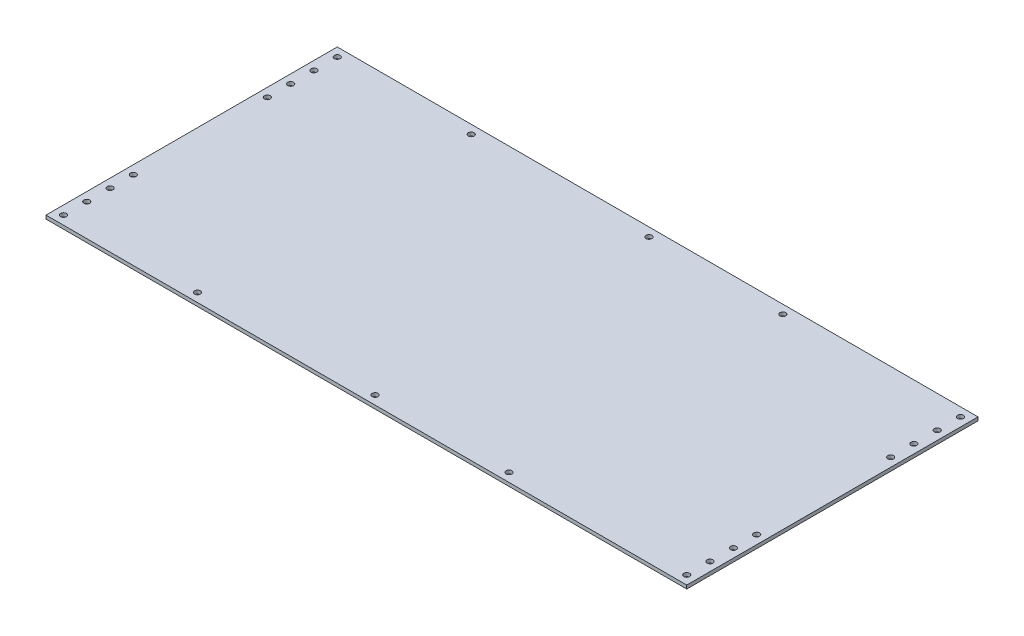
ISO-10303-21;
HEADER;
FILE_DESCRIPTION(('STEP AP214'),'2;1');
FILE_NAME('part.step','',(''),(''),'','','');
FILE_SCHEMA(('AUTOMOTIVE_DESIGN { 1 0 10303 214 1 1 1 1 }'));
ENDSEC;
DATA;
#1=APPLICATION_CONTEXT('core data for automotive mechanical design processes');
#2=APPLICATION_PROTOCOL_DEFINITION('international standard','automotive_design',2000,#1);
#3=PRODUCT_CONTEXT('',#1,'mechanical');
#4=PRODUCT('Part','Part','',(#3));
#5=PRODUCT_RELATED_PRODUCT_CATEGORY('part','',(#4));
#6=PRODUCT_DEFINITION_FORMATION('','',#4);
#7=PRODUCT_DEFINITION_CONTEXT('part definition',#1,'design');
#8=PRODUCT_DEFINITION('design','',#6,#7);
#9=PRODUCT_DEFINITION_SHAPE('','',#8);
#10=(LENGTH_UNIT() NAMED_UNIT(*) SI_UNIT(.MILLI.,.METRE.));
#11=(NAMED_UNIT(*) PLANE_ANGLE_UNIT() SI_UNIT($,.RADIAN.));
#12=(NAMED_UNIT(*) SI_UNIT($,.STERADIAN.) SOLID_ANGLE_UNIT());
#13=UNCERTAINTY_MEASURE_WITH_UNIT(LENGTH_MEASURE(1.E-05),#10,'distance_accuracy_value','');
#14=(GEOMETRIC_REPRESENTATION_CONTEXT(3) GLOBAL_UNCERTAINTY_ASSIGNED_CONTEXT((#13)) GLOBAL_UNIT_ASSIGNED_CONTEXT((#10,
#11,#12)) REPRESENTATION_CONTEXT('',''));
#15=CARTESIAN_POINT('',(0.,0.,0.));
#16=DIRECTION('',(0.,0.,1.));
#17=DIRECTION('',(1.,0.,0.));
#18=AXIS2_PLACEMENT_3D('',#15,#16,#17);
#19=CARTESIAN_POINT('',(-1100.,-12.,499.999999999999));
#20=DIRECTION('',(-1.,0.,0.));
#21=DIRECTION('',(0.,0.,1.));
#22=AXIS2_PLACEMENT_3D('',#19,#20,#21);
#23=PLANE('',#22);
#24=DIRECTION('',(0.,0.,1.));
#25=VECTOR('',#24,1.);
#26=CARTESIAN_POINT('',(-1100.,0.,499.999999999999));
#27=LINE('',#26,#25);
#28=CARTESIAN_POINT('',(-1100.,0.,-499.999999999999));
#29=VERTEX_POINT('',#28);
#30=CARTESIAN_POINT('',(-1100.,0.,499.999999999999));
#31=VERTEX_POINT('',#30);
#32=EDGE_CURVE('E98',#29,#31,#27,.T.);
#33=ORIENTED_EDGE('',*,*,#32,.F.);
#34=DIRECTION('',(0.,1.,0.));
#35=VECTOR('',#34,1.);
#36=CARTESIAN_POINT('',(-1100.,-12.,-499.999999999999));
#37=LINE('',#36,#35);
#38=CARTESIAN_POINT('',(-1100.,-12.,-499.999999999999));
#39=VERTEX_POINT('',#38);
#40=EDGE_CURVE('E11',#39,#29,#37,.T.);
#41=ORIENTED_EDGE('',*,*,#40,.F.);
#42=DIRECTION('',(0.,0.,1.));
#43=VECTOR('',#42,1.);
#44=CARTESIAN_POINT('',(-1100.,-12.,499.999999999999));
#45=LINE('',#44,#43);
#46=CARTESIAN_POINT('',(-1100.,-12.,499.999999999999));
#47=VERTEX_POINT('',#46);
#48=EDGE_CURVE('E91',#39,#47,#45,.T.);
#49=ORIENTED_EDGE('',*,*,#48,.T.);
#50=DIRECTION('',(0.,1.,0.));
#51=VECTOR('',#50,1.);
#52=CARTESIAN_POINT('',(-1100.,-12.,499.999999999999));
#53=LINE('',#52,#51);
#54=EDGE_CURVE('E36',#47,#31,#53,.T.);
#55=ORIENTED_EDGE('',*,*,#54,.T.);
#56=EDGE_LOOP('',(#33,#41,#49,#55));
#57=FACE_BOUND('',#56,.T.);
#58=ADVANCED_FACE('F33',(#57),#23,.T.);
#59=CARTESIAN_POINT('',(-1100.,-12.,-499.999999999999));
#60=DIRECTION('',(0.,0.,-1.));
#61=DIRECTION('',(-1.,0.,0.));
#62=AXIS2_PLACEMENT_3D('',#59,#60,#61);
#63=PLANE('',#62);
#64=DIRECTION('',(-1.,0.,0.));
#65=VECTOR('',#64,1.);
#66=CARTESIAN_POINT('',(-1100.,0.,-499.999999999999));
#67=LINE('',#66,#65);
#68=CARTESIAN_POINT('',(1100.,0.,-499.999999999999));
#69=VERTEX_POINT('',#68);
#70=EDGE_CURVE('E93',#69,#29,#67,.T.);
#71=ORIENTED_EDGE('',*,*,#70,.F.);
#72=DIRECTION('',(0.,1.,0.));
#73=VECTOR('',#72,1.);
#74=CARTESIAN_POINT('',(1100.,-12.,-499.999999999999));
#75=LINE('',#74,#73);
#76=CARTESIAN_POINT('',(1100.,-12.,-499.999999999999));
#77=VERTEX_POINT('',#76);
#78=EDGE_CURVE('E42',#77,#69,#75,.T.);
#79=ORIENTED_EDGE('',*,*,#78,.F.);
#80=DIRECTION('',(-1.,0.,0.));
#81=VECTOR('',#80,1.);
#82=CARTESIAN_POINT('',(-1100.,-12.,-499.999999999999));
#83=LINE('',#82,#81);
#84=EDGE_CURVE('E88',#77,#39,#83,.T.);
#85=ORIENTED_EDGE('',*,*,#84,.T.);
#86=ORIENTED_EDGE('',*,*,#40,.T.);
#87=EDGE_LOOP('',(#71,#79,#85,#86));
#88=FACE_BOUND('',#87,.T.);
#89=ADVANCED_FACE('F109',(#88),#63,.T.);
#90=CARTESIAN_POINT('',(1100.,-12.,500.000000000001));
#91=DIRECTION('',(1.,0.,0.));
#92=DIRECTION('',(0.,0.,-1.));
#93=AXIS2_PLACEMENT_3D('',#90,#91,#92);
#94=PLANE('',#93);
#95=DIRECTION('',(0.,0.,-1.));
#96=VECTOR('',#95,1.);
#97=CARTESIAN_POINT('',(1100.,0.,500.000000000001));
#98=LINE('',#97,#96);
#99=CARTESIAN_POINT('',(1100.,0.,500.000000000001));
#100=VERTEX_POINT('',#99);
#101=EDGE_CURVE('E83',#100,#69,#98,.T.);
#102=ORIENTED_EDGE('',*,*,#101,.F.);
#103=DIRECTION('',(0.,1.,0.));
#104=VECTOR('',#103,1.);
#105=CARTESIAN_POINT('',(1100.,-12.,500.000000000001));
#106=LINE('',#105,#104);
#107=CARTESIAN_POINT('',(1100.,-12.,500.000000000001));
#108=VERTEX_POINT('',#107);
#109=EDGE_CURVE('E78',#108,#100,#106,.T.);
#110=ORIENTED_EDGE('',*,*,#109,.F.);
#111=DIRECTION('',(0.,0.,-1.));
#112=VECTOR('',#111,1.);
#113=CARTESIAN_POINT('',(1100.,-12.,500.000000000001));
#114=LINE('',#113,#112);
#115=EDGE_CURVE('E81',#108,#77,#114,.T.);
#116=ORIENTED_EDGE('',*,*,#115,.T.);
#117=ORIENTED_EDGE('',*,*,#78,.T.);
#118=EDGE_LOOP('',(#102,#110,#116,#117));
#119=FACE_BOUND('',#118,.T.);
#120=ADVANCED_FACE('F80',(#119),#94,.T.);
#121=CARTESIAN_POINT('',(-1100.,-12.,499.999999999999));
#122=DIRECTION('',(0.,0.,1.));
#123=DIRECTION('',(1.,0.,0.));
#124=AXIS2_PLACEMENT_3D('',#121,#122,#123);
#125=PLANE('',#124);
#126=DIRECTION('',(1.,0.,0.));
#127=VECTOR('',#126,1.);
#128=CARTESIAN_POINT('',(-1100.,0.,499.999999999999));
#129=LINE('',#128,#127);
#130=EDGE_CURVE('E101',#31,#100,#129,.T.);
#131=ORIENTED_EDGE('',*,*,#130,.F.);
#132=ORIENTED_EDGE('',*,*,#54,.F.);
#133=DIRECTION('',(1.,0.,0.));
#134=VECTOR('',#133,1.);
#135=CARTESIAN_POINT('',(-1100.,-12.,499.999999999999));
#136=LINE('',#135,#134);
#137=EDGE_CURVE('E87',#47,#108,#136,.T.);
#138=ORIENTED_EDGE('',*,*,#137,.T.);
#139=ORIENTED_EDGE('',*,*,#109,.T.);
#140=EDGE_LOOP('',(#131,#132,#138,#139));
#141=FACE_BOUND('',#140,.T.);
#142=ADVANCED_FACE('F90',(#141),#125,.T.);
#143=CARTESIAN_POINT('',(0.,-12.,0.));
#144=DIRECTION('',(0.,-1.,0.));
#145=DIRECTION('',(0.,0.,-1.));
#146=AXIS2_PLACEMENT_3D('',#143,#144,#145);
#147=PLANE('',#146);
#148=CARTESIAN_POINT('',(-1070.,-12.,230.000000000003));
#149=DIRECTION('',(0.,1.,0.));
#150=DIRECTION('',(0.,0.,-1.));
#151=AXIS2_PLACEMENT_3D('',#148,#149,#150);
#152=CIRCLE('',#151,10.0000000000001);
#153=CARTESIAN_POINT('',(-1070.,-12.,220.000000000003));
#154=VERTEX_POINT('',#153);
#155=EDGE_CURVE('E222',#154,#154,#152,.T.);
#156=ORIENTED_EDGE('',*,*,#155,.T.);
#157=EDGE_LOOP('',(#156));
#158=FACE_BOUND('',#157,.T.);
#159=CARTESIAN_POINT('',(-1070.,-12.,310.000000000002));
#160=DIRECTION('',(0.,1.,0.));
#161=DIRECTION('',(0.,0.,-1.));
#162=AXIS2_PLACEMENT_3D('',#159,#160,#161);
#163=CIRCLE('',#162,9.99999999999988);
#164=CARTESIAN_POINT('',(-1070.,-12.,300.000000000002));
#165=VERTEX_POINT('',#164);
#166=EDGE_CURVE('E230',#165,#165,#163,.T.);
#167=ORIENTED_EDGE('',*,*,#166,.T.);
#168=EDGE_LOOP('',(#167));
#169=FACE_BOUND('',#168,.T.);
#170=CARTESIAN_POINT('',(-1070.,-12.,390.000000000001));
#171=DIRECTION('',(0.,1.,0.));
#172=DIRECTION('',(0.,0.,-1.));
#173=AXIS2_PLACEMENT_3D('',#170,#171,#172);
#174=CIRCLE('',#173,9.99999999999797);
#175=CARTESIAN_POINT('',(-1070.,-12.,380.000000000003));
#176=VERTEX_POINT('',#175);
#177=EDGE_CURVE('E236',#176,#176,#174,.T.);
#178=ORIENTED_EDGE('',*,*,#177,.T.);
#179=EDGE_LOOP('',(#178));
#180=FACE_BOUND('',#179,.T.);
#181=CARTESIAN_POINT('',(-1070.,-12.,470.));
#182=DIRECTION('',(0.,1.,0.));
#183=DIRECTION('',(0.,0.,-1.));
#184=AXIS2_PLACEMENT_3D('',#181,#182,#183);
#185=CIRCLE('',#184,10.0000000000001);
#186=CARTESIAN_POINT('',(-1070.,-12.,460.));
#187=VERTEX_POINT('',#186);
#188=EDGE_CURVE('E242',#187,#187,#185,.T.);
#189=ORIENTED_EDGE('',*,*,#188,.T.);
#190=EDGE_LOOP('',(#189));
#191=FACE_BOUND('',#190,.T.);
#192=CARTESIAN_POINT('',(-609.999999999998,-12.,469.999999999999));
#193=DIRECTION('',(0.,1.,0.));
#194=DIRECTION('',(0.,0.,-1.));
#195=AXIS2_PLACEMENT_3D('',#192,#193,#194);
#196=CIRCLE('',#195,9.99999999999998);
#197=CARTESIAN_POINT('',(-609.999999999998,-12.,459.999999999999));
#198=VERTEX_POINT('',#197);
#199=EDGE_CURVE('E248',#198,#198,#196,.T.);
#200=ORIENTED_EDGE('',*,*,#199,.T.);
#201=EDGE_LOOP('',(#200));
#202=FACE_BOUND('',#201,.T.);
#203=CARTESIAN_POINT('',(1.99840144432528E-12,-12.,469.999999999999));
#204=DIRECTION('',(0.,1.,0.));
#205=DIRECTION('',(0.,0.,-1.));
#206=AXIS2_PLACEMENT_3D('',#203,#204,#205);
#207=CIRCLE('',#206,9.99999999999998);
#208=CARTESIAN_POINT('',(1.99840144432528E-12,-12.,459.999999999999));
#209=VERTEX_POINT('',#208);
#210=EDGE_CURVE('E254',#209,#209,#207,.T.);
#211=ORIENTED_EDGE('',*,*,#210,.T.);
#212=EDGE_LOOP('',(#211));
#213=FACE_BOUND('',#212,.T.);
#214=CARTESIAN_POINT('',(460.000000000002,-12.,469.999999999999));
#215=DIRECTION('',(0.,1.,0.));
#216=DIRECTION('',(0.,0.,-1.));
#217=AXIS2_PLACEMENT_3D('',#214,#215,#216);
#218=CIRCLE('',#217,10.0000000000001);
#219=CARTESIAN_POINT('',(460.000000000002,-12.,459.999999999999));
#220=VERTEX_POINT('',#219);
#221=EDGE_CURVE('E260',#220,#220,#218,.T.);
#222=ORIENTED_EDGE('',*,*,#221,.T.);
#223=EDGE_LOOP('',(#222));
#224=FACE_BOUND('',#223,.T.);
#225=CARTESIAN_POINT('',(1070.,-12.,469.999999999999));
#226=DIRECTION('',(0.,1.,0.));
#227=DIRECTION('',(0.,0.,-1.));
#228=AXIS2_PLACEMENT_3D('',#225,#226,#227);
#229=CIRCLE('',#228,10.0000000000001);
#230=CARTESIAN_POINT('',(1070.,-12.,459.999999999999));
#231=VERTEX_POINT('',#230);
#232=EDGE_CURVE('E266',#231,#231,#229,.T.);
#233=ORIENTED_EDGE('',*,*,#232,.T.);
#234=EDGE_LOOP('',(#233));
#235=FACE_BOUND('',#234,.T.);
#236=CARTESIAN_POINT('',(1070.,-12.,390.));
#237=DIRECTION('',(0.,1.,0.));
#238=DIRECTION('',(0.,0.,-1.));
#239=AXIS2_PLACEMENT_3D('',#236,#237,#238);
#240=CIRCLE('',#239,9.99999999999818);
#241=CARTESIAN_POINT('',(1070.,-12.,380.000000000002));
#242=VERTEX_POINT('',#241);
#243=EDGE_CURVE('E272',#242,#242,#240,.T.);
#244=ORIENTED_EDGE('',*,*,#243,.T.);
#245=EDGE_LOOP('',(#244));
#246=FACE_BOUND('',#245,.T.);
#247=CARTESIAN_POINT('',(1070.,-12.,310.000000000001));
#248=DIRECTION('',(0.,1.,0.));
#249=DIRECTION('',(0.,0.,-1.));
#250=AXIS2_PLACEMENT_3D('',#247,#248,#249);
#251=CIRCLE('',#250,10.0000000000001);
#252=CARTESIAN_POINT('',(1070.,-12.,300.000000000001));
#253=VERTEX_POINT('',#252);
#254=EDGE_CURVE('E278',#253,#253,#251,.T.);
#255=ORIENTED_EDGE('',*,*,#254,.T.);
#256=EDGE_LOOP('',(#255));
#257=FACE_BOUND('',#256,.T.);
#258=CARTESIAN_POINT('',(1070.,-12.,230.000000000002));
#259=DIRECTION('',(0.,1.,0.));
#260=DIRECTION('',(0.,0.,-1.));
#261=AXIS2_PLACEMENT_3D('',#258,#259,#260);
#262=CIRCLE('',#261,10.0000000000001);
#263=CARTESIAN_POINT('',(1070.,-12.,220.000000000002));
#264=VERTEX_POINT('',#263);
#265=EDGE_CURVE('E284',#264,#264,#262,.T.);
#266=ORIENTED_EDGE('',*,*,#265,.T.);
#267=EDGE_LOOP('',(#266));
#268=FACE_BOUND('',#267,.T.);
#269=CARTESIAN_POINT('',(-1070.,-12.,-310.000000000001));
#270=DIRECTION('',(0.,1.,0.));
#271=DIRECTION('',(0.,0.,1.));
#272=AXIS2_PLACEMENT_3D('',#269,#270,#271);
#273=CIRCLE('',#272,9.99999999999988);
#274=CARTESIAN_POINT('',(-1070.,-12.,-300.000000000001));
#275=VERTEX_POINT('',#274);
#276=EDGE_CURVE('E290',#275,#275,#273,.T.);
#277=ORIENTED_EDGE('',*,*,#276,.T.);
#278=EDGE_LOOP('',(#277));
#279=FACE_BOUND('',#278,.T.);
#280=CARTESIAN_POINT('',(-1070.,-12.,-230.000000000002));
#281=DIRECTION('',(0.,1.,0.));
#282=DIRECTION('',(0.,0.,1.));
#283=AXIS2_PLACEMENT_3D('',#280,#281,#282);
#284=CIRCLE('',#283,10.0000000000001);
#285=CARTESIAN_POINT('',(-1070.,-12.,-220.000000000002));
#286=VERTEX_POINT('',#285);
#287=EDGE_CURVE('E296',#286,#286,#284,.T.);
#288=ORIENTED_EDGE('',*,*,#287,.T.);
#289=EDGE_LOOP('',(#288));
#290=FACE_BOUND('',#289,.T.);
#291=CARTESIAN_POINT('',(-1070.,-12.,-390.));
#292=DIRECTION('',(0.,1.,0.));
#293=DIRECTION('',(0.,0.,1.));
#294=AXIS2_PLACEMENT_3D('',#291,#292,#293);
#295=CIRCLE('',#294,9.99999999999797);
#296=CARTESIAN_POINT('',(-1070.,-12.,-380.000000000002));
#297=VERTEX_POINT('',#296);
#298=EDGE_CURVE('E302',#297,#297,#295,.T.);
#299=ORIENTED_EDGE('',*,*,#298,.T.);
#300=EDGE_LOOP('',(#299));
#301=FACE_BOUND('',#300,.T.);
#302=CARTESIAN_POINT('',(-609.999999999998,-12.,-469.999999999999));
#303=DIRECTION('',(0.,1.,0.));
#304=DIRECTION('',(0.,0.,1.));
#305=AXIS2_PLACEMENT_3D('',#302,#303,#304);
#306=CIRCLE('',#305,9.99999999999998);
#307=CARTESIAN_POINT('',(-609.999999999998,-12.,-459.999999999999));
#308=VERTEX_POINT('',#307);
#309=EDGE_CURVE('E308',#308,#308,#306,.T.);
#310=ORIENTED_EDGE('',*,*,#309,.T.);
#311=EDGE_LOOP('',(#310));
#312=FACE_BOUND('',#311,.T.);
#313=CARTESIAN_POINT('',(1.99840144432528E-12,-12.,-469.999999999999));
#314=DIRECTION('',(0.,1.,0.));
#315=DIRECTION('',(0.,0.,1.));
#316=AXIS2_PLACEMENT_3D('',#313,#314,#315);
#317=CIRCLE('',#316,9.99999999999998);
#318=CARTESIAN_POINT('',(1.99840144432528E-12,-12.,-459.999999999999));
#319=VERTEX_POINT('',#318);
#320=EDGE_CURVE('E314',#319,#319,#317,.T.);
#321=ORIENTED_EDGE('',*,*,#320,.T.);
#322=EDGE_LOOP('',(#321));
#323=FACE_BOUND('',#322,.T.);
#324=CARTESIAN_POINT('',(460.000000000002,-12.,-469.999999999999));
#325=DIRECTION('',(0.,1.,0.));
#326=DIRECTION('',(0.,0.,1.));
#327=AXIS2_PLACEMENT_3D('',#324,#325,#326);
#328=CIRCLE('',#327,10.0000000000001);
#329=CARTESIAN_POINT('',(460.000000000002,-12.,-459.999999999999));
#330=VERTEX_POINT('',#329);
#331=EDGE_CURVE('E320',#330,#330,#328,.T.);
#332=ORIENTED_EDGE('',*,*,#331,.T.);
#333=EDGE_LOOP('',(#332));
#334=FACE_BOUND('',#333,.T.);
#335=CARTESIAN_POINT('',(1070.,-12.,-390.));
#336=DIRECTION('',(0.,1.,0.));
#337=DIRECTION('',(0.,0.,1.));
#338=AXIS2_PLACEMENT_3D('',#335,#336,#337);
#339=CIRCLE('',#338,9.99999999999818);
#340=CARTESIAN_POINT('',(1070.,-12.,-380.000000000002));
#341=VERTEX_POINT('',#340);
#342=EDGE_CURVE('E326',#341,#341,#339,.T.);
#343=ORIENTED_EDGE('',*,*,#342,.T.);
#344=EDGE_LOOP('',(#343));
#345=FACE_BOUND('',#344,.T.);
#346=CARTESIAN_POINT('',(1070.,-12.,-310.000000000001));
#347=DIRECTION('',(0.,1.,0.));
#348=DIRECTION('',(0.,0.,1.));
#349=AXIS2_PLACEMENT_3D('',#346,#347,#348);
#350=CIRCLE('',#349,10.0000000000001);
#351=CARTESIAN_POINT('',(1070.,-12.,-300.000000000001));
#352=VERTEX_POINT('',#351);
#353=EDGE_CURVE('E332',#352,#352,#350,.T.);
#354=ORIENTED_EDGE('',*,*,#353,.T.);
#355=EDGE_LOOP('',(#354));
#356=FACE_BOUND('',#355,.T.);
#357=CARTESIAN_POINT('',(1070.,-12.,-230.000000000002));
#358=DIRECTION('',(0.,1.,0.));
#359=DIRECTION('',(0.,0.,1.));
#360=AXIS2_PLACEMENT_3D('',#357,#358,#359);
#361=CIRCLE('',#360,10.0000000000001);
#362=CARTESIAN_POINT('',(1070.,-12.,-220.000000000002));
#363=VERTEX_POINT('',#362);
#364=EDGE_CURVE('E338',#363,#363,#361,.T.);
#365=ORIENTED_EDGE('',*,*,#364,.T.);
#366=EDGE_LOOP('',(#365));
#367=FACE_BOUND('',#366,.T.);
#368=CARTESIAN_POINT('',(1070.,-12.,-469.999999999999));
#369=DIRECTION('',(0.,1.,0.));
#370=DIRECTION('',(0.,0.,1.));
#371=AXIS2_PLACEMENT_3D('',#368,#369,#370);
#372=CIRCLE('',#371,10.0000000000001);
#373=CARTESIAN_POINT('',(1070.,-12.,-459.999999999999));
#374=VERTEX_POINT('',#373);
#375=EDGE_CURVE('E344',#374,#374,#372,.T.);
#376=ORIENTED_EDGE('',*,*,#375,.T.);
#377=EDGE_LOOP('',(#376));
#378=FACE_BOUND('',#377,.T.);
#379=CARTESIAN_POINT('',(-1070.,-12.,-469.999999999999));
#380=DIRECTION('',(0.,1.,0.));
#381=DIRECTION('',(0.,0.,1.));
#382=AXIS2_PLACEMENT_3D('',#379,#380,#381);
#383=CIRCLE('',#382,9.99999999999988);
#384=CARTESIAN_POINT('',(-1070.,-12.,-459.999999999999));
#385=VERTEX_POINT('',#384);
#386=EDGE_CURVE('E102',#385,#385,#383,.T.);
#387=ORIENTED_EDGE('',*,*,#386,.T.);
#388=EDGE_LOOP('',(#387));
#389=FACE_BOUND('',#388,.T.);
#390=ORIENTED_EDGE('',*,*,#48,.F.);
#391=ORIENTED_EDGE('',*,*,#84,.F.);
#392=ORIENTED_EDGE('',*,*,#115,.F.);
#393=ORIENTED_EDGE('',*,*,#137,.F.);
#394=EDGE_LOOP('',(#390,#391,#392,#393));
#395=FACE_BOUND('',#394,.T.);
#396=ADVANCED_FACE('F86',(#158,#169,#180,#191,#202,#213,#224,#235,#246,#257,#268,#279,#290,#301,
#312,#323,#334,#345,#356,#367,#378,#389,#395),#147,.T.);
#397=CARTESIAN_POINT('',(0.,0.,0.));
#398=DIRECTION('',(0.,-1.,0.));
#399=DIRECTION('',(0.,0.,-1.));
#400=AXIS2_PLACEMENT_3D('',#397,#398,#399);
#401=PLANE('',#400);
#402=CARTESIAN_POINT('',(-1070.,0.,230.000000000003));
#403=DIRECTION('',(0.,1.,0.));
#404=DIRECTION('',(0.,0.,-1.));
#405=AXIS2_PLACEMENT_3D('',#402,#403,#404);
#406=CIRCLE('',#405,10.0000000000001);
#407=CARTESIAN_POINT('',(-1070.,0.,220.000000000003));
#408=VERTEX_POINT('',#407);
#409=EDGE_CURVE('E225',#408,#408,#406,.T.);
#410=ORIENTED_EDGE('',*,*,#409,.F.);
#411=EDGE_LOOP('',(#410));
#412=FACE_BOUND('',#411,.T.);
#413=CARTESIAN_POINT('',(-1070.,0.,310.000000000002));
#414=DIRECTION('',(0.,1.,0.));
#415=DIRECTION('',(0.,0.,-1.));
#416=AXIS2_PLACEMENT_3D('',#413,#414,#415);
#417=CIRCLE('',#416,9.99999999999988);
#418=CARTESIAN_POINT('',(-1070.,0.,300.000000000002));
#419=VERTEX_POINT('',#418);
#420=EDGE_CURVE('E227',#419,#419,#417,.T.);
#421=ORIENTED_EDGE('',*,*,#420,.F.);
#422=EDGE_LOOP('',(#421));
#423=FACE_BOUND('',#422,.T.);
#424=CARTESIAN_POINT('',(-1070.,0.,390.000000000001));
#425=DIRECTION('',(0.,1.,0.));
#426=DIRECTION('',(0.,0.,-1.));
#427=AXIS2_PLACEMENT_3D('',#424,#425,#426);
#428=CIRCLE('',#427,9.99999999999797);
#429=CARTESIAN_POINT('',(-1070.,0.,380.000000000003));
#430=VERTEX_POINT('',#429);
#431=EDGE_CURVE('E233',#430,#430,#428,.T.);
#432=ORIENTED_EDGE('',*,*,#431,.F.);
#433=EDGE_LOOP('',(#432));
#434=FACE_BOUND('',#433,.T.);
#435=CARTESIAN_POINT('',(-1070.,0.,470.));
#436=DIRECTION('',(0.,1.,0.));
#437=DIRECTION('',(0.,0.,-1.));
#438=AXIS2_PLACEMENT_3D('',#435,#436,#437);
#439=CIRCLE('',#438,10.0000000000001);
#440=CARTESIAN_POINT('',(-1070.,0.,460.));
#441=VERTEX_POINT('',#440);
#442=EDGE_CURVE('E239',#441,#441,#439,.T.);
#443=ORIENTED_EDGE('',*,*,#442,.F.);
#444=EDGE_LOOP('',(#443));
#445=FACE_BOUND('',#444,.T.);
#446=CARTESIAN_POINT('',(-609.999999999998,0.,469.999999999999));
#447=DIRECTION('',(0.,1.,0.));
#448=DIRECTION('',(0.,0.,-1.));
#449=AXIS2_PLACEMENT_3D('',#446,#447,#448);
#450=CIRCLE('',#449,9.99999999999998);
#451=CARTESIAN_POINT('',(-609.999999999998,0.,459.999999999999));
#452=VERTEX_POINT('',#451);
#453=EDGE_CURVE('E245',#452,#452,#450,.T.);
#454=ORIENTED_EDGE('',*,*,#453,.F.);
#455=EDGE_LOOP('',(#454));
#456=FACE_BOUND('',#455,.T.);
#457=CARTESIAN_POINT('',(1.99840144432528E-12,0.,469.999999999999));
#458=DIRECTION('',(0.,1.,0.));
#459=DIRECTION('',(0.,0.,-1.));
#460=AXIS2_PLACEMENT_3D('',#457,#458,#459);
#461=CIRCLE('',#460,9.99999999999998);
#462=CARTESIAN_POINT('',(1.99840144432528E-12,0.,459.999999999999));
#463=VERTEX_POINT('',#462);
#464=EDGE_CURVE('E251',#463,#463,#461,.T.);
#465=ORIENTED_EDGE('',*,*,#464,.F.);
#466=EDGE_LOOP('',(#465));
#467=FACE_BOUND('',#466,.T.);
#468=CARTESIAN_POINT('',(460.000000000002,0.,469.999999999999));
#469=DIRECTION('',(0.,1.,0.));
#470=DIRECTION('',(0.,0.,-1.));
#471=AXIS2_PLACEMENT_3D('',#468,#469,#470);
#472=CIRCLE('',#471,10.0000000000001);
#473=CARTESIAN_POINT('',(460.000000000002,0.,459.999999999999));
#474=VERTEX_POINT('',#473);
#475=EDGE_CURVE('E257',#474,#474,#472,.T.);
#476=ORIENTED_EDGE('',*,*,#475,.F.);
#477=EDGE_LOOP('',(#476));
#478=FACE_BOUND('',#477,.T.);
#479=CARTESIAN_POINT('',(1070.,0.,469.999999999999));
#480=DIRECTION('',(0.,1.,0.));
#481=DIRECTION('',(0.,0.,-1.));
#482=AXIS2_PLACEMENT_3D('',#479,#480,#481);
#483=CIRCLE('',#482,10.0000000000001);
#484=CARTESIAN_POINT('',(1070.,0.,459.999999999999));
#485=VERTEX_POINT('',#484);
#486=EDGE_CURVE('E263',#485,#485,#483,.T.);
#487=ORIENTED_EDGE('',*,*,#486,.F.);
#488=EDGE_LOOP('',(#487));
#489=FACE_BOUND('',#488,.T.);
#490=CARTESIAN_POINT('',(1070.,0.,390.));
#491=DIRECTION('',(0.,1.,0.));
#492=DIRECTION('',(0.,0.,-1.));
#493=AXIS2_PLACEMENT_3D('',#490,#491,#492);
#494=CIRCLE('',#493,9.99999999999818);
#495=CARTESIAN_POINT('',(1070.,0.,380.000000000002));
#496=VERTEX_POINT('',#495);
#497=EDGE_CURVE('E269',#496,#496,#494,.T.);
#498=ORIENTED_EDGE('',*,*,#497,.F.);
#499=EDGE_LOOP('',(#498));
#500=FACE_BOUND('',#499,.T.);
#501=CARTESIAN_POINT('',(1070.,0.,310.000000000001));
#502=DIRECTION('',(0.,1.,0.));
#503=DIRECTION('',(0.,0.,-1.));
#504=AXIS2_PLACEMENT_3D('',#501,#502,#503);
#505=CIRCLE('',#504,10.0000000000001);
#506=CARTESIAN_POINT('',(1070.,0.,300.000000000001));
#507=VERTEX_POINT('',#506);
#508=EDGE_CURVE('E275',#507,#507,#505,.T.);
#509=ORIENTED_EDGE('',*,*,#508,.F.);
#510=EDGE_LOOP('',(#509));
#511=FACE_BOUND('',#510,.T.);
#512=CARTESIAN_POINT('',(1070.,0.,230.000000000002));
#513=DIRECTION('',(0.,1.,0.));
#514=DIRECTION('',(0.,0.,-1.));
#515=AXIS2_PLACEMENT_3D('',#512,#513,#514);
#516=CIRCLE('',#515,10.0000000000001);
#517=CARTESIAN_POINT('',(1070.,0.,220.000000000002));
#518=VERTEX_POINT('',#517);
#519=EDGE_CURVE('E281',#518,#518,#516,.T.);
#520=ORIENTED_EDGE('',*,*,#519,.F.);
#521=EDGE_LOOP('',(#520));
#522=FACE_BOUND('',#521,.T.);
#523=CARTESIAN_POINT('',(-1070.,0.,-310.000000000001));
#524=DIRECTION('',(0.,1.,0.));
#525=DIRECTION('',(0.,0.,1.));
#526=AXIS2_PLACEMENT_3D('',#523,#524,#525);
#527=CIRCLE('',#526,9.99999999999988);
#528=CARTESIAN_POINT('',(-1070.,0.,-300.000000000001));
#529=VERTEX_POINT('',#528);
#530=EDGE_CURVE('E287',#529,#529,#527,.T.);
#531=ORIENTED_EDGE('',*,*,#530,.F.);
#532=EDGE_LOOP('',(#531));
#533=FACE_BOUND('',#532,.T.);
#534=CARTESIAN_POINT('',(-1070.,0.,-230.000000000002));
#535=DIRECTION('',(0.,1.,0.));
#536=DIRECTION('',(0.,0.,1.));
#537=AXIS2_PLACEMENT_3D('',#534,#535,#536);
#538=CIRCLE('',#537,10.0000000000001);
#539=CARTESIAN_POINT('',(-1070.,0.,-220.000000000002));
#540=VERTEX_POINT('',#539);
#541=EDGE_CURVE('E293',#540,#540,#538,.T.);
#542=ORIENTED_EDGE('',*,*,#541,.F.);
#543=EDGE_LOOP('',(#542));
#544=FACE_BOUND('',#543,.T.);
#545=CARTESIAN_POINT('',(-1070.,0.,-390.));
#546=DIRECTION('',(0.,1.,0.));
#547=DIRECTION('',(0.,0.,1.));
#548=AXIS2_PLACEMENT_3D('',#545,#546,#547);
#549=CIRCLE('',#548,9.99999999999797);
#550=CARTESIAN_POINT('',(-1070.,0.,-380.000000000002));
#551=VERTEX_POINT('',#550);
#552=EDGE_CURVE('E299',#551,#551,#549,.T.);
#553=ORIENTED_EDGE('',*,*,#552,.F.);
#554=EDGE_LOOP('',(#553));
#555=FACE_BOUND('',#554,.T.);
#556=CARTESIAN_POINT('',(-609.999999999998,0.,-469.999999999999));
#557=DIRECTION('',(0.,1.,0.));
#558=DIRECTION('',(0.,0.,1.));
#559=AXIS2_PLACEMENT_3D('',#556,#557,#558);
#560=CIRCLE('',#559,9.99999999999998);
#561=CARTESIAN_POINT('',(-609.999999999998,0.,-459.999999999999));
#562=VERTEX_POINT('',#561);
#563=EDGE_CURVE('E305',#562,#562,#560,.T.);
#564=ORIENTED_EDGE('',*,*,#563,.F.);
#565=EDGE_LOOP('',(#564));
#566=FACE_BOUND('',#565,.T.);
#567=CARTESIAN_POINT('',(1.99840144432528E-12,0.,-469.999999999999));
#568=DIRECTION('',(0.,1.,0.));
#569=DIRECTION('',(0.,0.,1.));
#570=AXIS2_PLACEMENT_3D('',#567,#568,#569);
#571=CIRCLE('',#570,9.99999999999998);
#572=CARTESIAN_POINT('',(1.99840144432528E-12,0.,-459.999999999999));
#573=VERTEX_POINT('',#572);
#574=EDGE_CURVE('E311',#573,#573,#571,.T.);
#575=ORIENTED_EDGE('',*,*,#574,.F.);
#576=EDGE_LOOP('',(#575));
#577=FACE_BOUND('',#576,.T.);
#578=CARTESIAN_POINT('',(460.000000000002,0.,-469.999999999999));
#579=DIRECTION('',(0.,1.,0.));
#580=DIRECTION('',(0.,0.,1.));
#581=AXIS2_PLACEMENT_3D('',#578,#579,#580);
#582=CIRCLE('',#581,10.0000000000001);
#583=CARTESIAN_POINT('',(460.000000000002,0.,-459.999999999999));
#584=VERTEX_POINT('',#583);
#585=EDGE_CURVE('E317',#584,#584,#582,.T.);
#586=ORIENTED_EDGE('',*,*,#585,.F.);
#587=EDGE_LOOP('',(#586));
#588=FACE_BOUND('',#587,.T.);
#589=CARTESIAN_POINT('',(1070.,0.,-390.));
#590=DIRECTION('',(0.,1.,0.));
#591=DIRECTION('',(0.,0.,1.));
#592=AXIS2_PLACEMENT_3D('',#589,#590,#591);
#593=CIRCLE('',#592,9.99999999999818);
#594=CARTESIAN_POINT('',(1070.,0.,-380.000000000002));
#595=VERTEX_POINT('',#594);
#596=EDGE_CURVE('E323',#595,#595,#593,.T.);
#597=ORIENTED_EDGE('',*,*,#596,.F.);
#598=EDGE_LOOP('',(#597));
#599=FACE_BOUND('',#598,.T.);
#600=CARTESIAN_POINT('',(1070.,0.,-310.000000000001));
#601=DIRECTION('',(0.,1.,0.));
#602=DIRECTION('',(0.,0.,1.));
#603=AXIS2_PLACEMENT_3D('',#600,#601,#602);
#604=CIRCLE('',#603,10.0000000000001);
#605=CARTESIAN_POINT('',(1070.,0.,-300.000000000001));
#606=VERTEX_POINT('',#605);
#607=EDGE_CURVE('E329',#606,#606,#604,.T.);
#608=ORIENTED_EDGE('',*,*,#607,.F.);
#609=EDGE_LOOP('',(#608));
#610=FACE_BOUND('',#609,.T.);
#611=CARTESIAN_POINT('',(1070.,0.,-230.000000000002));
#612=DIRECTION('',(0.,1.,0.));
#613=DIRECTION('',(0.,0.,1.));
#614=AXIS2_PLACEMENT_3D('',#611,#612,#613);
#615=CIRCLE('',#614,10.0000000000001);
#616=CARTESIAN_POINT('',(1070.,0.,-220.000000000002));
#617=VERTEX_POINT('',#616);
#618=EDGE_CURVE('E335',#617,#617,#615,.T.);
#619=ORIENTED_EDGE('',*,*,#618,.F.);
#620=EDGE_LOOP('',(#619));
#621=FACE_BOUND('',#620,.T.);
#622=CARTESIAN_POINT('',(1070.,0.,-469.999999999999));
#623=DIRECTION('',(0.,1.,0.));
#624=DIRECTION('',(0.,0.,1.));
#625=AXIS2_PLACEMENT_3D('',#622,#623,#624);
#626=CIRCLE('',#625,10.0000000000001);
#627=CARTESIAN_POINT('',(1070.,0.,-459.999999999999));
#628=VERTEX_POINT('',#627);
#629=EDGE_CURVE('E341',#628,#628,#626,.T.);
#630=ORIENTED_EDGE('',*,*,#629,.F.);
#631=EDGE_LOOP('',(#630));
#632=FACE_BOUND('',#631,.T.);
#633=CARTESIAN_POINT('',(-1070.,0.,-469.999999999999));
#634=DIRECTION('',(0.,1.,0.));
#635=DIRECTION('',(0.,0.,1.));
#636=AXIS2_PLACEMENT_3D('',#633,#634,#635);
#637=CIRCLE('',#636,9.99999999999988);
#638=CARTESIAN_POINT('',(-1070.,0.,-459.999999999999));
#639=VERTEX_POINT('',#638);
#640=EDGE_CURVE('E347',#639,#639,#637,.T.);
#641=ORIENTED_EDGE('',*,*,#640,.F.);
#642=EDGE_LOOP('',(#641));
#643=FACE_BOUND('',#642,.T.);
#644=ORIENTED_EDGE('',*,*,#32,.T.);
#645=ORIENTED_EDGE('',*,*,#130,.T.);
#646=ORIENTED_EDGE('',*,*,#101,.T.);
#647=ORIENTED_EDGE('',*,*,#70,.T.);
#648=EDGE_LOOP('',(#644,#645,#646,#647));
#649=FACE_BOUND('',#648,.T.);
#650=ADVANCED_FACE('F108',(#412,#423,#434,#445,#456,#467,#478,#489,#500,#511,#522,#533,#544,
#555,#566,#577,#588,#599,#610,#621,#632,#643,#649),#401,.F.);
#651=CARTESIAN_POINT('',(-1070.,-12.,-469.999999999999));
#652=DIRECTION('',(0.,1.,0.));
#653=DIRECTION('',(0.,0.,1.));
#654=AXIS2_PLACEMENT_3D('',#651,#652,#653);
#655=CYLINDRICAL_SURFACE('',#654,9.99999999999988);
#656=ORIENTED_EDGE('',*,*,#386,.F.);
#657=EDGE_LOOP('',(#656));
#658=FACE_BOUND('',#657,.T.);
#659=ORIENTED_EDGE('',*,*,#640,.T.);
#660=EDGE_LOOP('',(#659));
#661=FACE_BOUND('',#660,.T.);
#662=ADVANCED_FACE('F127',(#658,#661),#655,.F.);
#663=CARTESIAN_POINT('',(1070.,-12.,-469.999999999999));
#664=DIRECTION('',(0.,1.,0.));
#665=DIRECTION('',(0.,0.,1.));
#666=AXIS2_PLACEMENT_3D('',#663,#664,#665);
#667=CYLINDRICAL_SURFACE('',#666,10.0000000000001);
#668=ORIENTED_EDGE('',*,*,#375,.F.);
#669=EDGE_LOOP('',(#668));
#670=FACE_BOUND('',#669,.T.);
#671=ORIENTED_EDGE('',*,*,#629,.T.);
#672=EDGE_LOOP('',(#671));
#673=FACE_BOUND('',#672,.T.);
#674=ADVANCED_FACE('F134',(#670,#673),#667,.F.);
#675=CARTESIAN_POINT('',(1070.,-12.,-230.000000000002));
#676=DIRECTION('',(0.,1.,0.));
#677=DIRECTION('',(0.,0.,1.));
#678=AXIS2_PLACEMENT_3D('',#675,#676,#677);
#679=CYLINDRICAL_SURFACE('',#678,10.0000000000001);
#680=ORIENTED_EDGE('',*,*,#364,.F.);
#681=EDGE_LOOP('',(#680));
#682=FACE_BOUND('',#681,.T.);
#683=ORIENTED_EDGE('',*,*,#618,.T.);
#684=EDGE_LOOP('',(#683));
#685=FACE_BOUND('',#684,.T.);
#686=ADVANCED_FACE('F138',(#682,#685),#679,.F.);
#687=CARTESIAN_POINT('',(1070.,-12.,-310.000000000001));
#688=DIRECTION('',(0.,1.,0.));
#689=DIRECTION('',(0.,0.,1.));
#690=AXIS2_PLACEMENT_3D('',#687,#688,#689);
#691=CYLINDRICAL_SURFACE('',#690,10.0000000000001);
#692=ORIENTED_EDGE('',*,*,#353,.F.);
#693=EDGE_LOOP('',(#692));
#694=FACE_BOUND('',#693,.T.);
#695=ORIENTED_EDGE('',*,*,#607,.T.);
#696=EDGE_LOOP('',(#695));
#697=FACE_BOUND('',#696,.T.);
#698=ADVANCED_FACE('F142',(#694,#697),#691,.F.);
#699=CARTESIAN_POINT('',(1070.,-12.,-390.));
#700=DIRECTION('',(0.,1.,0.));
#701=DIRECTION('',(0.,0.,1.));
#702=AXIS2_PLACEMENT_3D('',#699,#700,#701);
#703=CYLINDRICAL_SURFACE('',#702,9.99999999999818);
#704=ORIENTED_EDGE('',*,*,#342,.F.);
#705=EDGE_LOOP('',(#704));
#706=FACE_BOUND('',#705,.T.);
#707=ORIENTED_EDGE('',*,*,#596,.T.);
#708=EDGE_LOOP('',(#707));
#709=FACE_BOUND('',#708,.T.);
#710=ADVANCED_FACE('F146',(#706,#709),#703,.F.);
#711=CARTESIAN_POINT('',(460.000000000002,-12.,-469.999999999999));
#712=DIRECTION('',(0.,1.,0.));
#713=DIRECTION('',(0.,0.,1.));
#714=AXIS2_PLACEMENT_3D('',#711,#712,#713);
#715=CYLINDRICAL_SURFACE('',#714,10.0000000000001);
#716=ORIENTED_EDGE('',*,*,#331,.F.);
#717=EDGE_LOOP('',(#716));
#718=FACE_BOUND('',#717,.T.);
#719=ORIENTED_EDGE('',*,*,#585,.T.);
#720=EDGE_LOOP('',(#719));
#721=FACE_BOUND('',#720,.T.);
#722=ADVANCED_FACE('F150',(#718,#721),#715,.F.);
#723=CARTESIAN_POINT('',(1.99840144432528E-12,-12.,-469.999999999999));
#724=DIRECTION('',(0.,1.,0.));
#725=DIRECTION('',(0.,0.,1.));
#726=AXIS2_PLACEMENT_3D('',#723,#724,#725);
#727=CYLINDRICAL_SURFACE('',#726,9.99999999999998);
#728=ORIENTED_EDGE('',*,*,#320,.F.);
#729=EDGE_LOOP('',(#728));
#730=FACE_BOUND('',#729,.T.);
#731=ORIENTED_EDGE('',*,*,#574,.T.);
#732=EDGE_LOOP('',(#731));
#733=FACE_BOUND('',#732,.T.);
#734=ADVANCED_FACE('F154',(#730,#733),#727,.F.);
#735=CARTESIAN_POINT('',(-609.999999999998,-12.,-469.999999999999));
#736=DIRECTION('',(0.,1.,0.));
#737=DIRECTION('',(0.,0.,1.));
#738=AXIS2_PLACEMENT_3D('',#735,#736,#737);
#739=CYLINDRICAL_SURFACE('',#738,9.99999999999998);
#740=ORIENTED_EDGE('',*,*,#309,.F.);
#741=EDGE_LOOP('',(#740));
#742=FACE_BOUND('',#741,.T.);
#743=ORIENTED_EDGE('',*,*,#563,.T.);
#744=EDGE_LOOP('',(#743));
#745=FACE_BOUND('',#744,.T.);
#746=ADVANCED_FACE('F158',(#742,#745),#739,.F.);
#747=CARTESIAN_POINT('',(-1070.,-12.,-390.));
#748=DIRECTION('',(0.,1.,0.));
#749=DIRECTION('',(0.,0.,1.));
#750=AXIS2_PLACEMENT_3D('',#747,#748,#749);
#751=CYLINDRICAL_SURFACE('',#750,9.99999999999797);
#752=ORIENTED_EDGE('',*,*,#298,.F.);
#753=EDGE_LOOP('',(#752));
#754=FACE_BOUND('',#753,.T.);
#755=ORIENTED_EDGE('',*,*,#552,.T.);
#756=EDGE_LOOP('',(#755));
#757=FACE_BOUND('',#756,.T.);
#758=ADVANCED_FACE('F162',(#754,#757),#751,.F.);
#759=CARTESIAN_POINT('',(-1070.,-12.,-230.000000000002));
#760=DIRECTION('',(0.,1.,0.));
#761=DIRECTION('',(0.,0.,1.));
#762=AXIS2_PLACEMENT_3D('',#759,#760,#761);
#763=CYLINDRICAL_SURFACE('',#762,10.0000000000001);
#764=ORIENTED_EDGE('',*,*,#287,.F.);
#765=EDGE_LOOP('',(#764));
#766=FACE_BOUND('',#765,.T.);
#767=ORIENTED_EDGE('',*,*,#541,.T.);
#768=EDGE_LOOP('',(#767));
#769=FACE_BOUND('',#768,.T.);
#770=ADVANCED_FACE('F166',(#766,#769),#763,.F.);
#771=CARTESIAN_POINT('',(-1070.,-12.,-310.000000000001));
#772=DIRECTION('',(0.,1.,0.));
#773=DIRECTION('',(0.,0.,1.));
#774=AXIS2_PLACEMENT_3D('',#771,#772,#773);
#775=CYLINDRICAL_SURFACE('',#774,9.99999999999988);
#776=ORIENTED_EDGE('',*,*,#276,.F.);
#777=EDGE_LOOP('',(#776));
#778=FACE_BOUND('',#777,.T.);
#779=ORIENTED_EDGE('',*,*,#530,.T.);
#780=EDGE_LOOP('',(#779));
#781=FACE_BOUND('',#780,.T.);
#782=ADVANCED_FACE('F170',(#778,#781),#775,.F.);
#783=CARTESIAN_POINT('',(1070.,-12.,230.000000000002));
#784=DIRECTION('',(0.,1.,0.));
#785=DIRECTION('',(0.,0.,1.));
#786=AXIS2_PLACEMENT_3D('',#783,#784,#785);
#787=CYLINDRICAL_SURFACE('',#786,10.0000000000001);
#788=ORIENTED_EDGE('',*,*,#265,.F.);
#789=EDGE_LOOP('',(#788));
#790=FACE_BOUND('',#789,.T.);
#791=ORIENTED_EDGE('',*,*,#519,.T.);
#792=EDGE_LOOP('',(#791));
#793=FACE_BOUND('',#792,.T.);
#794=ADVANCED_FACE('F174',(#790,#793),#787,.F.);
#795=CARTESIAN_POINT('',(1070.,-12.,310.000000000001));
#796=DIRECTION('',(0.,1.,0.));
#797=DIRECTION('',(0.,0.,1.));
#798=AXIS2_PLACEMENT_3D('',#795,#796,#797);
#799=CYLINDRICAL_SURFACE('',#798,10.0000000000001);
#800=ORIENTED_EDGE('',*,*,#254,.F.);
#801=EDGE_LOOP('',(#800));
#802=FACE_BOUND('',#801,.T.);
#803=ORIENTED_EDGE('',*,*,#508,.T.);
#804=EDGE_LOOP('',(#803));
#805=FACE_BOUND('',#804,.T.);
#806=ADVANCED_FACE('F178',(#802,#805),#799,.F.);
#807=CARTESIAN_POINT('',(1070.,-12.,390.));
#808=DIRECTION('',(0.,1.,0.));
#809=DIRECTION('',(0.,0.,1.));
#810=AXIS2_PLACEMENT_3D('',#807,#808,#809);
#811=CYLINDRICAL_SURFACE('',#810,9.99999999999818);
#812=ORIENTED_EDGE('',*,*,#243,.F.);
#813=EDGE_LOOP('',(#812));
#814=FACE_BOUND('',#813,.T.);
#815=ORIENTED_EDGE('',*,*,#497,.T.);
#816=EDGE_LOOP('',(#815));
#817=FACE_BOUND('',#816,.T.);
#818=ADVANCED_FACE('F182',(#814,#817),#811,.F.);
#819=CARTESIAN_POINT('',(1070.,-12.,469.999999999999));
#820=DIRECTION('',(0.,1.,0.));
#821=DIRECTION('',(0.,0.,1.));
#822=AXIS2_PLACEMENT_3D('',#819,#820,#821);
#823=CYLINDRICAL_SURFACE('',#822,10.0000000000001);
#824=ORIENTED_EDGE('',*,*,#232,.F.);
#825=EDGE_LOOP('',(#824));
#826=FACE_BOUND('',#825,.T.);
#827=ORIENTED_EDGE('',*,*,#486,.T.);
#828=EDGE_LOOP('',(#827));
#829=FACE_BOUND('',#828,.T.);
#830=ADVANCED_FACE('F186',(#826,#829),#823,.F.);
#831=CARTESIAN_POINT('',(460.000000000002,-12.,469.999999999999));
#832=DIRECTION('',(0.,1.,0.));
#833=DIRECTION('',(0.,0.,1.));
#834=AXIS2_PLACEMENT_3D('',#831,#832,#833);
#835=CYLINDRICAL_SURFACE('',#834,10.0000000000001);
#836=ORIENTED_EDGE('',*,*,#221,.F.);
#837=EDGE_LOOP('',(#836));
#838=FACE_BOUND('',#837,.T.);
#839=ORIENTED_EDGE('',*,*,#475,.T.);
#840=EDGE_LOOP('',(#839));
#841=FACE_BOUND('',#840,.T.);
#842=ADVANCED_FACE('F190',(#838,#841),#835,.F.);
#843=CARTESIAN_POINT('',(1.99840144432528E-12,-12.,469.999999999999));
#844=DIRECTION('',(0.,1.,0.));
#845=DIRECTION('',(0.,0.,1.));
#846=AXIS2_PLACEMENT_3D('',#843,#844,#845);
#847=CYLINDRICAL_SURFACE('',#846,9.99999999999998);
#848=ORIENTED_EDGE('',*,*,#210,.F.);
#849=EDGE_LOOP('',(#848));
#850=FACE_BOUND('',#849,.T.);
#851=ORIENTED_EDGE('',*,*,#464,.T.);
#852=EDGE_LOOP('',(#851));
#853=FACE_BOUND('',#852,.T.);
#854=ADVANCED_FACE('F194',(#850,#853),#847,.F.);
#855=CARTESIAN_POINT('',(-609.999999999998,-12.,469.999999999999));
#856=DIRECTION('',(0.,1.,0.));
#857=DIRECTION('',(0.,0.,1.));
#858=AXIS2_PLACEMENT_3D('',#855,#856,#857);
#859=CYLINDRICAL_SURFACE('',#858,9.99999999999998);
#860=ORIENTED_EDGE('',*,*,#199,.F.);
#861=EDGE_LOOP('',(#860));
#862=FACE_BOUND('',#861,.T.);
#863=ORIENTED_EDGE('',*,*,#453,.T.);
#864=EDGE_LOOP('',(#863));
#865=FACE_BOUND('',#864,.T.);
#866=ADVANCED_FACE('F198',(#862,#865),#859,.F.);
#867=CARTESIAN_POINT('',(-1070.,-12.,470.));
#868=DIRECTION('',(0.,1.,0.));
#869=DIRECTION('',(0.,0.,1.));
#870=AXIS2_PLACEMENT_3D('',#867,#868,#869);
#871=CYLINDRICAL_SURFACE('',#870,10.0000000000001);
#872=ORIENTED_EDGE('',*,*,#188,.F.);
#873=EDGE_LOOP('',(#872));
#874=FACE_BOUND('',#873,.T.);
#875=ORIENTED_EDGE('',*,*,#442,.T.);
#876=EDGE_LOOP('',(#875));
#877=FACE_BOUND('',#876,.T.);
#878=ADVANCED_FACE('F202',(#874,#877),#871,.F.);
#879=CARTESIAN_POINT('',(-1070.,-12.,390.000000000001));
#880=DIRECTION('',(0.,1.,0.));
#881=DIRECTION('',(0.,0.,1.));
#882=AXIS2_PLACEMENT_3D('',#879,#880,#881);
#883=CYLINDRICAL_SURFACE('',#882,9.99999999999797);
#884=ORIENTED_EDGE('',*,*,#177,.F.);
#885=EDGE_LOOP('',(#884));
#886=FACE_BOUND('',#885,.T.);
#887=ORIENTED_EDGE('',*,*,#431,.T.);
#888=EDGE_LOOP('',(#887));
#889=FACE_BOUND('',#888,.T.);
#890=ADVANCED_FACE('F206',(#886,#889),#883,.F.);
#891=CARTESIAN_POINT('',(-1070.,-12.,310.000000000002));
#892=DIRECTION('',(0.,1.,0.));
#893=DIRECTION('',(0.,0.,1.));
#894=AXIS2_PLACEMENT_3D('',#891,#892,#893);
#895=CYLINDRICAL_SURFACE('',#894,9.99999999999988);
#896=ORIENTED_EDGE('',*,*,#166,.F.);
#897=EDGE_LOOP('',(#896));
#898=FACE_BOUND('',#897,.T.);
#899=ORIENTED_EDGE('',*,*,#420,.T.);
#900=EDGE_LOOP('',(#899));
#901=FACE_BOUND('',#900,.T.);
#902=ADVANCED_FACE('F210',(#898,#901),#895,.F.);
#903=CARTESIAN_POINT('',(-1070.,-12.,230.000000000003));
#904=DIRECTION('',(0.,1.,0.));
#905=DIRECTION('',(0.,0.,1.));
#906=AXIS2_PLACEMENT_3D('',#903,#904,#905);
#907=CYLINDRICAL_SURFACE('',#906,10.0000000000001);
#908=ORIENTED_EDGE('',*,*,#155,.F.);
#909=EDGE_LOOP('',(#908));
#910=FACE_BOUND('',#909,.T.);
#911=ORIENTED_EDGE('',*,*,#409,.T.);
#912=EDGE_LOOP('',(#911));
#913=FACE_BOUND('',#912,.T.);
#914=ADVANCED_FACE('F214',(#910,#913),#907,.F.);
#915=CLOSED_SHELL('',(#58,#89,#120,#142,#396,#650,#662,#674,#686,#698,#710,#722,#734,#746,#758,
#770,#782,#794,#806,#818,#830,#842,#854,#866,#878,#890,#902,#914));
#916=MANIFOLD_SOLID_BREP('B2',#915);
#917=ADVANCED_BREP_SHAPE_REPRESENTATION('',(#18,#916),#14);
#918=SHAPE_DEFINITION_REPRESENTATION(#9,#917);
ENDSEC;
END-ISO-10303-21;
